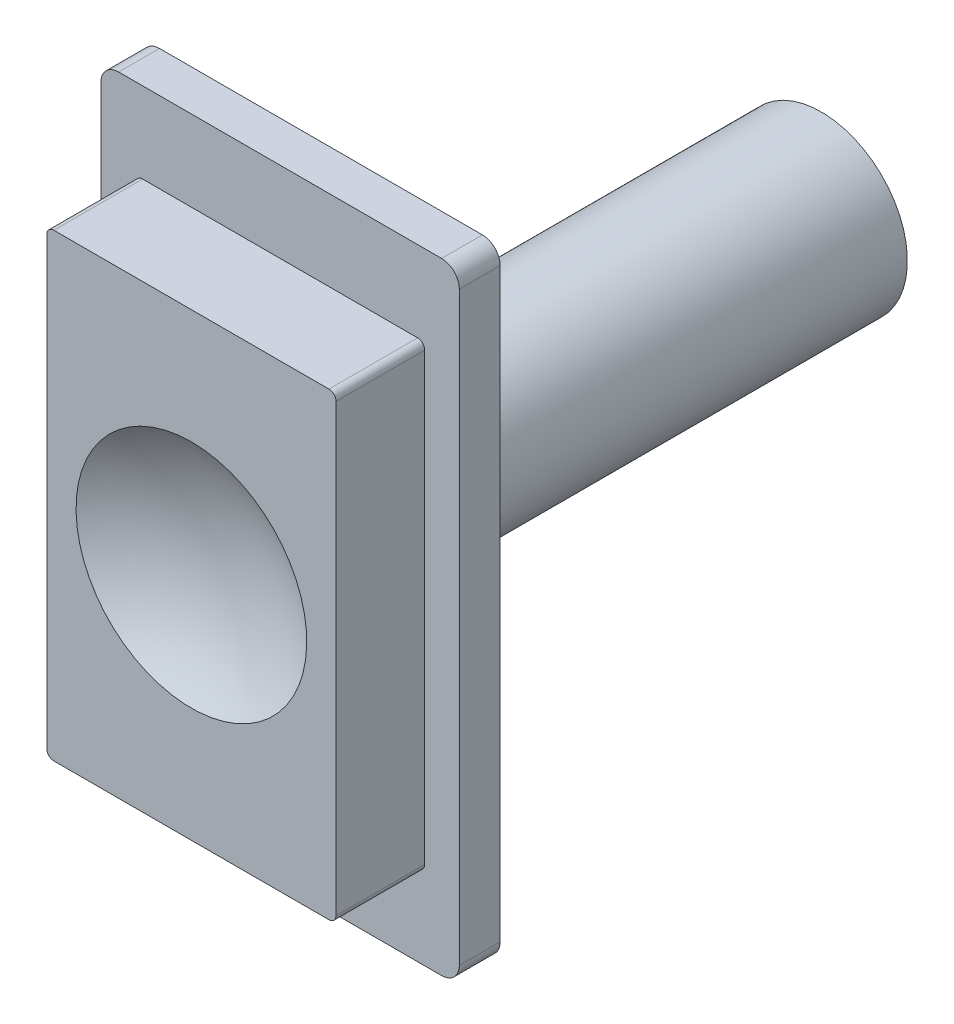
ISO-10303-21;
HEADER;
FILE_DESCRIPTION(('STEP AP214'),'2;1');
FILE_NAME('part.step','',(''),(''),'','','');
FILE_SCHEMA(('AUTOMOTIVE_DESIGN { 1 0 10303 214 1 1 1 1 }'));
ENDSEC;
DATA;
#1=APPLICATION_CONTEXT('core data for automotive mechanical design processes');
#2=APPLICATION_PROTOCOL_DEFINITION('international standard','automotive_design',2000,#1);
#3=PRODUCT_CONTEXT('',#1,'mechanical');
#4=PRODUCT('Part','Part','',(#3));
#5=PRODUCT_RELATED_PRODUCT_CATEGORY('part','',(#4));
#6=PRODUCT_DEFINITION_FORMATION('','',#4);
#7=PRODUCT_DEFINITION_CONTEXT('part definition',#1,'design');
#8=PRODUCT_DEFINITION('design','',#6,#7);
#9=PRODUCT_DEFINITION_SHAPE('','',#8);
#10=(LENGTH_UNIT() NAMED_UNIT(*) SI_UNIT(.MILLI.,.METRE.));
#11=(NAMED_UNIT(*) PLANE_ANGLE_UNIT() SI_UNIT($,.RADIAN.));
#12=(NAMED_UNIT(*) SI_UNIT($,.STERADIAN.) SOLID_ANGLE_UNIT());
#13=UNCERTAINTY_MEASURE_WITH_UNIT(LENGTH_MEASURE(1.E-05),#10,'distance_accuracy_value','');
#14=(GEOMETRIC_REPRESENTATION_CONTEXT(3) GLOBAL_UNCERTAINTY_ASSIGNED_CONTEXT((#13)) GLOBAL_UNIT_ASSIGNED_CONTEXT((#10,
#11,#12)) REPRESENTATION_CONTEXT('',''));
#15=CARTESIAN_POINT('',(0.,0.,0.));
#16=DIRECTION('',(0.,0.,1.));
#17=DIRECTION('',(1.,0.,0.));
#18=AXIS2_PLACEMENT_3D('',#15,#16,#17);
#19=CARTESIAN_POINT('',(0.,0.,2.3));
#20=DIRECTION('',(0.,0.,-1.));
#21=DIRECTION('',(-1.,0.,0.));
#22=AXIS2_PLACEMENT_3D('',#19,#20,#21);
#23=PLANE('',#22);
#24=DIRECTION('',(0.,-1.,0.));
#25=VECTOR('',#24,1.);
#26=CARTESIAN_POINT('',(-10.1,-17.5,2.3));
#27=LINE('',#26,#25);
#28=CARTESIAN_POINT('',(-10.1,16.5,2.3));
#29=VERTEX_POINT('',#28);
#30=CARTESIAN_POINT('',(-10.1,-16.5,2.3));
#31=VERTEX_POINT('',#30);
#32=EDGE_CURVE('E307',#29,#31,#27,.T.);
#33=ORIENTED_EDGE('',*,*,#32,.T.);
#34=CARTESIAN_POINT('',(-9.1,-16.5,2.3));
#35=DIRECTION('',(0.,0.,-1.));
#36=DIRECTION('',(-1.,0.,0.));
#37=AXIS2_PLACEMENT_3D('',#34,#35,#36);
#38=CIRCLE('',#37,1.);
#39=CARTESIAN_POINT('',(-9.1,-17.5,2.3));
#40=VERTEX_POINT('',#39);
#41=EDGE_CURVE('E351',#31,#40,#38,.F.);
#42=ORIENTED_EDGE('',*,*,#41,.T.);
#43=DIRECTION('',(1.,0.,0.));
#44=VECTOR('',#43,1.);
#45=CARTESIAN_POINT('',(10.1,-17.5,2.3));
#46=LINE('',#45,#44);
#47=CARTESIAN_POINT('',(9.1,-17.5,2.3));
#48=VERTEX_POINT('',#47);
#49=EDGE_CURVE('E311',#40,#48,#46,.T.);
#50=ORIENTED_EDGE('',*,*,#49,.T.);
#51=CARTESIAN_POINT('',(9.1,-16.5,2.3));
#52=DIRECTION('',(0.,0.,-1.));
#53=DIRECTION('',(-1.,0.,0.));
#54=AXIS2_PLACEMENT_3D('',#51,#52,#53);
#55=CIRCLE('',#54,1.);
#56=CARTESIAN_POINT('',(10.1,-16.5,2.3));
#57=VERTEX_POINT('',#56);
#58=EDGE_CURVE('E345',#48,#57,#55,.F.);
#59=ORIENTED_EDGE('',*,*,#58,.T.);
#60=DIRECTION('',(0.,1.,0.));
#61=VECTOR('',#60,1.);
#62=CARTESIAN_POINT('',(10.1,-17.5,2.3));
#63=LINE('',#62,#61);
#64=CARTESIAN_POINT('',(10.1,16.5,2.3));
#65=VERTEX_POINT('',#64);
#66=EDGE_CURVE('E314',#57,#65,#63,.T.);
#67=ORIENTED_EDGE('',*,*,#66,.T.);
#68=CARTESIAN_POINT('',(9.1,16.5,2.3));
#69=DIRECTION('',(0.,0.,-1.));
#70=DIRECTION('',(-1.,0.,0.));
#71=AXIS2_PLACEMENT_3D('',#68,#69,#70);
#72=CIRCLE('',#71,1.);
#73=CARTESIAN_POINT('',(9.1,17.5,2.3));
#74=VERTEX_POINT('',#73);
#75=EDGE_CURVE('E347',#65,#74,#72,.F.);
#76=ORIENTED_EDGE('',*,*,#75,.T.);
#77=DIRECTION('',(-1.,0.,0.));
#78=VECTOR('',#77,1.);
#79=CARTESIAN_POINT('',(10.1,17.5,2.3));
#80=LINE('',#79,#78);
#81=CARTESIAN_POINT('',(-9.1,17.5,2.3));
#82=VERTEX_POINT('',#81);
#83=EDGE_CURVE('E304',#74,#82,#80,.T.);
#84=ORIENTED_EDGE('',*,*,#83,.T.);
#85=CARTESIAN_POINT('',(-9.1,16.5,2.3));
#86=DIRECTION('',(0.,0.,-1.));
#87=DIRECTION('',(-1.,0.,0.));
#88=AXIS2_PLACEMENT_3D('',#85,#86,#87);
#89=CIRCLE('',#88,1.);
#90=EDGE_CURVE('E349',#82,#29,#89,.F.);
#91=ORIENTED_EDGE('',*,*,#90,.T.);
#92=EDGE_LOOP('',(#33,#42,#50,#59,#67,#76,#84,#91));
#93=FACE_BOUND('',#92,.T.);
#94=DIRECTION('',(0.,1.,0.));
#95=VECTOR('',#94,1.);
#96=CARTESIAN_POINT('',(8.15,-12.95,2.3));
#97=LINE('',#96,#95);
#98=CARTESIAN_POINT('',(8.15,-12.55,2.3));
#99=VERTEX_POINT('',#98);
#100=CARTESIAN_POINT('',(8.15,12.55,2.3));
#101=VERTEX_POINT('',#100);
#102=EDGE_CURVE('E280',#99,#101,#97,.T.);
#103=ORIENTED_EDGE('',*,*,#102,.F.);
#104=CARTESIAN_POINT('',(7.75,-12.55,2.3));
#105=DIRECTION('',(0.,0.,-1.));
#106=DIRECTION('',(-1.,0.,0.));
#107=AXIS2_PLACEMENT_3D('',#104,#105,#106);
#108=CIRCLE('',#107,0.4);
#109=CARTESIAN_POINT('',(7.75,-12.95,2.3));
#110=VERTEX_POINT('',#109);
#111=EDGE_CURVE('E63',#99,#110,#108,.T.);
#112=ORIENTED_EDGE('',*,*,#111,.T.);
#113=DIRECTION('',(1.,0.,0.));
#114=VECTOR('',#113,1.);
#115=CARTESIAN_POINT('',(-8.15,-12.95,2.3));
#116=LINE('',#115,#114);
#117=CARTESIAN_POINT('',(-7.75,-12.95,2.3));
#118=VERTEX_POINT('',#117);
#119=EDGE_CURVE('E285',#118,#110,#116,.T.);
#120=ORIENTED_EDGE('',*,*,#119,.F.);
#121=CARTESIAN_POINT('',(-7.75,-12.55,2.3));
#122=DIRECTION('',(0.,0.,-1.));
#123=DIRECTION('',(-1.,0.,0.));
#124=AXIS2_PLACEMENT_3D('',#121,#122,#123);
#125=CIRCLE('',#124,0.4);
#126=CARTESIAN_POINT('',(-8.15,-12.55,2.3));
#127=VERTEX_POINT('',#126);
#128=EDGE_CURVE('E43',#118,#127,#125,.T.);
#129=ORIENTED_EDGE('',*,*,#128,.T.);
#130=DIRECTION('',(0.,-1.,0.));
#131=VECTOR('',#130,1.);
#132=CARTESIAN_POINT('',(-8.15,-12.95,2.3));
#133=LINE('',#132,#131);
#134=CARTESIAN_POINT('',(-8.15,12.55,2.3));
#135=VERTEX_POINT('',#134);
#136=EDGE_CURVE('E300',#135,#127,#133,.T.);
#137=ORIENTED_EDGE('',*,*,#136,.F.);
#138=CARTESIAN_POINT('',(-7.75,12.55,2.3));
#139=DIRECTION('',(0.,0.,-1.));
#140=DIRECTION('',(-1.,0.,0.));
#141=AXIS2_PLACEMENT_3D('',#138,#139,#140);
#142=CIRCLE('',#141,0.4);
#143=CARTESIAN_POINT('',(-7.75,12.95,2.3));
#144=VERTEX_POINT('',#143);
#145=EDGE_CURVE('E391',#135,#144,#142,.T.);
#146=ORIENTED_EDGE('',*,*,#145,.T.);
#147=DIRECTION('',(-1.,0.,0.));
#148=VECTOR('',#147,1.);
#149=CARTESIAN_POINT('',(-8.15,12.95,2.3));
#150=LINE('',#149,#148);
#151=CARTESIAN_POINT('',(7.75,12.95,2.3));
#152=VERTEX_POINT('',#151);
#153=EDGE_CURVE('E297',#152,#144,#150,.T.);
#154=ORIENTED_EDGE('',*,*,#153,.F.);
#155=CARTESIAN_POINT('',(7.75,12.55,2.3));
#156=DIRECTION('',(0.,0.,-1.));
#157=DIRECTION('',(-1.,0.,0.));
#158=AXIS2_PLACEMENT_3D('',#155,#156,#157);
#159=CIRCLE('',#158,0.4);
#160=EDGE_CURVE('E393',#152,#101,#159,.T.);
#161=ORIENTED_EDGE('',*,*,#160,.T.);
#162=EDGE_LOOP('',(#103,#112,#120,#129,#137,#146,#154,#161));
#163=FACE_BOUND('',#162,.T.);
#164=ADVANCED_FACE('F39',(#93,#163),#23,.F.);
#165=CARTESIAN_POINT('',(10.1,17.5,2.3));
#166=DIRECTION('',(0.,-1.,0.));
#167=DIRECTION('',(0.,0.,-1.));
#168=AXIS2_PLACEMENT_3D('',#165,#166,#167);
#169=PLANE('',#168);
#170=DIRECTION('',(-1.,0.,0.));
#171=VECTOR('',#170,1.);
#172=CARTESIAN_POINT('',(10.1,17.5,0.));
#173=LINE('',#172,#171);
#174=CARTESIAN_POINT('',(9.1,17.5,0.));
#175=VERTEX_POINT('',#174);
#176=CARTESIAN_POINT('',(-9.1,17.5,0.));
#177=VERTEX_POINT('',#176);
#178=EDGE_CURVE('E294',#175,#177,#173,.T.);
#179=ORIENTED_EDGE('',*,*,#178,.T.);
#180=DIRECTION('',(0.,0.,-1.));
#181=VECTOR('',#180,1.);
#182=CARTESIAN_POINT('',(-9.1,17.5,2.3));
#183=LINE('',#182,#181);
#184=EDGE_CURVE('E356',#177,#82,#183,.F.);
#185=ORIENTED_EDGE('',*,*,#184,.T.);
#186=ORIENTED_EDGE('',*,*,#83,.F.);
#187=DIRECTION('',(0.,0.,-1.));
#188=VECTOR('',#187,1.);
#189=CARTESIAN_POINT('',(9.1,17.5,2.3));
#190=LINE('',#189,#188);
#191=EDGE_CURVE('E353',#74,#175,#190,.T.);
#192=ORIENTED_EDGE('',*,*,#191,.T.);
#193=EDGE_LOOP('',(#179,#185,#186,#192));
#194=FACE_BOUND('',#193,.T.);
#195=ADVANCED_FACE('F442',(#194),#169,.F.);
#196=CARTESIAN_POINT('',(-10.1,-17.5,2.3));
#197=DIRECTION('',(1.,0.,0.));
#198=DIRECTION('',(0.,0.,-1.));
#199=AXIS2_PLACEMENT_3D('',#196,#197,#198);
#200=PLANE('',#199);
#201=DIRECTION('',(0.,-1.,0.));
#202=VECTOR('',#201,1.);
#203=CARTESIAN_POINT('',(-10.1,-17.5,0.));
#204=LINE('',#203,#202);
#205=CARTESIAN_POINT('',(-10.1,16.5,0.));
#206=VERTEX_POINT('',#205);
#207=CARTESIAN_POINT('',(-10.1,-16.5,0.));
#208=VERTEX_POINT('',#207);
#209=EDGE_CURVE('E320',#206,#208,#204,.T.);
#210=ORIENTED_EDGE('',*,*,#209,.T.);
#211=DIRECTION('',(0.,0.,-1.));
#212=VECTOR('',#211,1.);
#213=CARTESIAN_POINT('',(-10.1,-16.5,2.3));
#214=LINE('',#213,#212);
#215=EDGE_CURVE('E343',#208,#31,#214,.F.);
#216=ORIENTED_EDGE('',*,*,#215,.T.);
#217=ORIENTED_EDGE('',*,*,#32,.F.);
#218=DIRECTION('',(0.,0.,-1.));
#219=VECTOR('',#218,1.);
#220=CARTESIAN_POINT('',(-10.1,16.5,2.3));
#221=LINE('',#220,#219);
#222=EDGE_CURVE('E340',#29,#206,#221,.T.);
#223=ORIENTED_EDGE('',*,*,#222,.T.);
#224=EDGE_LOOP('',(#210,#216,#217,#223));
#225=FACE_BOUND('',#224,.T.);
#226=ADVANCED_FACE('F449',(#225),#200,.F.);
#227=CARTESIAN_POINT('',(10.1,-17.5,2.3));
#228=DIRECTION('',(0.,1.,0.));
#229=DIRECTION('',(0.,0.,1.));
#230=AXIS2_PLACEMENT_3D('',#227,#228,#229);
#231=PLANE('',#230);
#232=ORIENTED_EDGE('',*,*,#49,.F.);
#233=DIRECTION('',(0.,0.,-1.));
#234=VECTOR('',#233,1.);
#235=CARTESIAN_POINT('',(-9.1,-17.5,2.3));
#236=LINE('',#235,#234);
#237=CARTESIAN_POINT('',(-9.1,-17.5,0.));
#238=VERTEX_POINT('',#237);
#239=EDGE_CURVE('E329',#40,#238,#236,.T.);
#240=ORIENTED_EDGE('',*,*,#239,.T.);
#241=DIRECTION('',(1.,0.,0.));
#242=VECTOR('',#241,1.);
#243=CARTESIAN_POINT('',(10.1,-17.5,0.));
#244=LINE('',#243,#242);
#245=CARTESIAN_POINT('',(9.1,-17.5,0.));
#246=VERTEX_POINT('',#245);
#247=EDGE_CURVE('E323',#238,#246,#244,.T.);
#248=ORIENTED_EDGE('',*,*,#247,.T.);
#249=DIRECTION('',(0.,0.,-1.));
#250=VECTOR('',#249,1.);
#251=CARTESIAN_POINT('',(9.1,-17.5,2.3));
#252=LINE('',#251,#250);
#253=EDGE_CURVE('E317',#246,#48,#252,.F.);
#254=ORIENTED_EDGE('',*,*,#253,.T.);
#255=EDGE_LOOP('',(#232,#240,#248,#254));
#256=FACE_BOUND('',#255,.T.);
#257=ADVANCED_FACE('F462',(#256),#231,.F.);
#258=CARTESIAN_POINT('',(10.1,-17.5,2.3));
#259=DIRECTION('',(-1.,0.,0.));
#260=DIRECTION('',(0.,0.,1.));
#261=AXIS2_PLACEMENT_3D('',#258,#259,#260);
#262=PLANE('',#261);
#263=DIRECTION('',(0.,1.,0.));
#264=VECTOR('',#263,1.);
#265=CARTESIAN_POINT('',(10.1,-17.5,0.));
#266=LINE('',#265,#264);
#267=CARTESIAN_POINT('',(10.1,-16.5,0.));
#268=VERTEX_POINT('',#267);
#269=CARTESIAN_POINT('',(10.1,16.5,0.));
#270=VERTEX_POINT('',#269);
#271=EDGE_CURVE('E308',#268,#270,#266,.T.);
#272=ORIENTED_EDGE('',*,*,#271,.T.);
#273=DIRECTION('',(0.,0.,-1.));
#274=VECTOR('',#273,1.);
#275=CARTESIAN_POINT('',(10.1,16.5,2.3));
#276=LINE('',#275,#274);
#277=EDGE_CURVE('E361',#270,#65,#276,.F.);
#278=ORIENTED_EDGE('',*,*,#277,.T.);
#279=ORIENTED_EDGE('',*,*,#66,.F.);
#280=DIRECTION('',(0.,0.,-1.));
#281=VECTOR('',#280,1.);
#282=CARTESIAN_POINT('',(10.1,-16.5,2.3));
#283=LINE('',#282,#281);
#284=EDGE_CURVE('E358',#57,#268,#283,.T.);
#285=ORIENTED_EDGE('',*,*,#284,.T.);
#286=EDGE_LOOP('',(#272,#278,#279,#285));
#287=FACE_BOUND('',#286,.T.);
#288=ADVANCED_FACE('F458',(#287),#262,.F.);
#289=CARTESIAN_POINT('',(0.,0.,0.));
#290=DIRECTION('',(0.,0.,-1.));
#291=DIRECTION('',(-1.,0.,0.));
#292=AXIS2_PLACEMENT_3D('',#289,#290,#291);
#293=PLANE('',#292);
#294=CARTESIAN_POINT('',(0.,0.,0.));
#295=DIRECTION('',(0.,0.,-1.));
#296=DIRECTION('',(-1.,0.,0.));
#297=AXIS2_PLACEMENT_3D('',#294,#295,#296);
#298=CIRCLE('',#297,4.85);
#299=CARTESIAN_POINT('',(-4.85,0.,0.));
#300=VERTEX_POINT('',#299);
#301=EDGE_CURVE('E11',#300,#300,#298,.T.);
#302=ORIENTED_EDGE('',*,*,#301,.F.);
#303=EDGE_LOOP('',(#302));
#304=FACE_BOUND('',#303,.T.);
#305=ORIENTED_EDGE('',*,*,#247,.F.);
#306=CARTESIAN_POINT('',(-9.1,-16.5,0.));
#307=DIRECTION('',(0.,0.,-1.));
#308=DIRECTION('',(-1.,0.,0.));
#309=AXIS2_PLACEMENT_3D('',#306,#307,#308);
#310=CIRCLE('',#309,1.);
#311=EDGE_CURVE('E338',#238,#208,#310,.T.);
#312=ORIENTED_EDGE('',*,*,#311,.T.);
#313=ORIENTED_EDGE('',*,*,#209,.F.);
#314=CARTESIAN_POINT('',(-9.1,16.5,0.));
#315=DIRECTION('',(0.,0.,-1.));
#316=DIRECTION('',(-1.,0.,0.));
#317=AXIS2_PLACEMENT_3D('',#314,#315,#316);
#318=CIRCLE('',#317,1.);
#319=EDGE_CURVE('E336',#206,#177,#318,.T.);
#320=ORIENTED_EDGE('',*,*,#319,.T.);
#321=ORIENTED_EDGE('',*,*,#178,.F.);
#322=CARTESIAN_POINT('',(9.1,16.5,0.));
#323=DIRECTION('',(0.,0.,-1.));
#324=DIRECTION('',(-1.,0.,0.));
#325=AXIS2_PLACEMENT_3D('',#322,#323,#324);
#326=CIRCLE('',#325,1.);
#327=EDGE_CURVE('E334',#175,#270,#326,.T.);
#328=ORIENTED_EDGE('',*,*,#327,.T.);
#329=ORIENTED_EDGE('',*,*,#271,.F.);
#330=CARTESIAN_POINT('',(9.1,-16.5,0.));
#331=DIRECTION('',(0.,0.,-1.));
#332=DIRECTION('',(-1.,0.,0.));
#333=AXIS2_PLACEMENT_3D('',#330,#331,#332);
#334=CIRCLE('',#333,1.);
#335=EDGE_CURVE('E332',#268,#246,#334,.T.);
#336=ORIENTED_EDGE('',*,*,#335,.T.);
#337=EDGE_LOOP('',(#305,#312,#313,#320,#321,#328,#329,#336));
#338=FACE_BOUND('',#337,.T.);
#339=ADVANCED_FACE('F455',(#304,#338),#293,.T.);
#340=CARTESIAN_POINT('',(8.15,-12.95,7.3));
#341=DIRECTION('',(-1.,0.,0.));
#342=DIRECTION('',(0.,0.,1.));
#343=AXIS2_PLACEMENT_3D('',#340,#341,#342);
#344=PLANE('',#343);
#345=ORIENTED_EDGE('',*,*,#102,.T.);
#346=DIRECTION('',(0.,0.,-1.));
#347=VECTOR('',#346,1.);
#348=CARTESIAN_POINT('',(8.15,12.55,7.3));
#349=LINE('',#348,#347);
#350=CARTESIAN_POINT('',(8.15,12.55,7.3));
#351=VERTEX_POINT('',#350);
#352=EDGE_CURVE('E384',#101,#351,#349,.F.);
#353=ORIENTED_EDGE('',*,*,#352,.T.);
#354=DIRECTION('',(0.,1.,0.));
#355=VECTOR('',#354,1.);
#356=CARTESIAN_POINT('',(8.15,-12.95,7.3));
#357=LINE('',#356,#355);
#358=CARTESIAN_POINT('',(8.15,-12.55,7.3));
#359=VERTEX_POINT('',#358);
#360=EDGE_CURVE('E281',#359,#351,#357,.T.);
#361=ORIENTED_EDGE('',*,*,#360,.F.);
#362=DIRECTION('',(0.,0.,-1.));
#363=VECTOR('',#362,1.);
#364=CARTESIAN_POINT('',(8.15,-12.55,7.3));
#365=LINE('',#364,#363);
#366=EDGE_CURVE('E381',#359,#99,#365,.T.);
#367=ORIENTED_EDGE('',*,*,#366,.T.);
#368=EDGE_LOOP('',(#345,#353,#361,#367));
#369=FACE_BOUND('',#368,.T.);
#370=ADVANCED_FACE('F416',(#369),#344,.F.);
#371=CARTESIAN_POINT('',(-8.15,12.95,7.3));
#372=DIRECTION('',(0.,-1.,0.));
#373=DIRECTION('',(0.,0.,-1.));
#374=AXIS2_PLACEMENT_3D('',#371,#372,#373);
#375=PLANE('',#374);
#376=ORIENTED_EDGE('',*,*,#153,.T.);
#377=DIRECTION('',(0.,0.,-1.));
#378=VECTOR('',#377,1.);
#379=CARTESIAN_POINT('',(-7.75,12.95,7.3));
#380=LINE('',#379,#378);
#381=CARTESIAN_POINT('',(-7.75,12.95,7.3));
#382=VERTEX_POINT('',#381);
#383=EDGE_CURVE('E371',#144,#382,#380,.F.);
#384=ORIENTED_EDGE('',*,*,#383,.T.);
#385=DIRECTION('',(-1.,0.,0.));
#386=VECTOR('',#385,1.);
#387=CARTESIAN_POINT('',(-8.15,12.95,7.3));
#388=LINE('',#387,#386);
#389=CARTESIAN_POINT('',(7.75,12.95,7.3));
#390=VERTEX_POINT('',#389);
#391=EDGE_CURVE('E284',#390,#382,#388,.T.);
#392=ORIENTED_EDGE('',*,*,#391,.F.);
#393=DIRECTION('',(0.,0.,-1.));
#394=VECTOR('',#393,1.);
#395=CARTESIAN_POINT('',(7.75,12.95,7.3));
#396=LINE('',#395,#394);
#397=EDGE_CURVE('E368',#390,#152,#396,.T.);
#398=ORIENTED_EDGE('',*,*,#397,.T.);
#399=EDGE_LOOP('',(#376,#384,#392,#398));
#400=FACE_BOUND('',#399,.T.);
#401=ADVANCED_FACE('F424',(#400),#375,.F.);
#402=CARTESIAN_POINT('',(-8.15,-12.95,7.3));
#403=DIRECTION('',(1.,0.,0.));
#404=DIRECTION('',(0.,0.,-1.));
#405=AXIS2_PLACEMENT_3D('',#402,#403,#404);
#406=PLANE('',#405);
#407=DIRECTION('',(0.,-1.,0.));
#408=VECTOR('',#407,1.);
#409=CARTESIAN_POINT('',(-8.15,-12.95,7.3));
#410=LINE('',#409,#408);
#411=CARTESIAN_POINT('',(-8.15,12.55,7.3));
#412=VERTEX_POINT('',#411);
#413=CARTESIAN_POINT('',(-8.15,-12.55,7.3));
#414=VERTEX_POINT('',#413);
#415=EDGE_CURVE('E288',#412,#414,#410,.T.);
#416=ORIENTED_EDGE('',*,*,#415,.F.);
#417=DIRECTION('',(0.,0.,-1.));
#418=VECTOR('',#417,1.);
#419=CARTESIAN_POINT('',(-8.15,12.55,7.3));
#420=LINE('',#419,#418);
#421=EDGE_CURVE('E365',#412,#135,#420,.T.);
#422=ORIENTED_EDGE('',*,*,#421,.T.);
#423=ORIENTED_EDGE('',*,*,#136,.T.);
#424=DIRECTION('',(0.,0.,-1.));
#425=VECTOR('',#424,1.);
#426=CARTESIAN_POINT('',(-8.15,-12.55,7.3));
#427=LINE('',#426,#425);
#428=EDGE_CURVE('E363',#127,#414,#427,.F.);
#429=ORIENTED_EDGE('',*,*,#428,.T.);
#430=EDGE_LOOP('',(#416,#422,#423,#429));
#431=FACE_BOUND('',#430,.T.);
#432=ADVANCED_FACE('F400',(#431),#406,.F.);
#433=CARTESIAN_POINT('',(-8.15,-12.95,7.3));
#434=DIRECTION('',(0.,1.,0.));
#435=DIRECTION('',(0.,0.,1.));
#436=AXIS2_PLACEMENT_3D('',#433,#434,#435);
#437=PLANE('',#436);
#438=ORIENTED_EDGE('',*,*,#119,.T.);
#439=DIRECTION('',(0.,0.,-1.));
#440=VECTOR('',#439,1.);
#441=CARTESIAN_POINT('',(7.75,-12.95,7.3));
#442=LINE('',#441,#440);
#443=CARTESIAN_POINT('',(7.75,-12.95,7.3));
#444=VERTEX_POINT('',#443);
#445=EDGE_CURVE('E389',#110,#444,#442,.F.);
#446=ORIENTED_EDGE('',*,*,#445,.T.);
#447=DIRECTION('',(1.,0.,0.));
#448=VECTOR('',#447,1.);
#449=CARTESIAN_POINT('',(-8.15,-12.95,7.3));
#450=LINE('',#449,#448);
#451=CARTESIAN_POINT('',(-7.75,-12.95,7.3));
#452=VERTEX_POINT('',#451);
#453=EDGE_CURVE('E291',#452,#444,#450,.T.);
#454=ORIENTED_EDGE('',*,*,#453,.F.);
#455=DIRECTION('',(0.,0.,-1.));
#456=VECTOR('',#455,1.);
#457=CARTESIAN_POINT('',(-7.75,-12.95,7.3));
#458=LINE('',#457,#456);
#459=EDGE_CURVE('E386',#452,#118,#458,.T.);
#460=ORIENTED_EDGE('',*,*,#459,.T.);
#461=EDGE_LOOP('',(#438,#446,#454,#460));
#462=FACE_BOUND('',#461,.T.);
#463=ADVANCED_FACE('F408',(#462),#437,.F.);
#464=CARTESIAN_POINT('',(0.,0.,7.3));
#465=DIRECTION('',(0.,0.,-1.));
#466=DIRECTION('',(-1.,0.,0.));
#467=AXIS2_PLACEMENT_3D('',#464,#465,#466);
#468=PLANE('',#467);
#469=CARTESIAN_POINT('',(0.,0.,7.3));
#470=DIRECTION('',(0.,0.,-1.));
#471=DIRECTION('',(0.,1.,0.));
#472=AXIS2_PLACEMENT_3D('',#469,#470,#471);
#473=CIRCLE('',#472,6.5);
#474=CARTESIAN_POINT('',(0.,6.49999999999999,7.30000000000001));
#475=VERTEX_POINT('',#474);
#476=EDGE_CURVE('E276',#475,#475,#473,.T.);
#477=ORIENTED_EDGE('',*,*,#476,.T.);
#478=EDGE_LOOP('',(#477));
#479=FACE_BOUND('',#478,.T.);
#480=ORIENTED_EDGE('',*,*,#391,.T.);
#481=CARTESIAN_POINT('',(-7.75,12.55,7.3));
#482=DIRECTION('',(0.,0.,-1.));
#483=DIRECTION('',(-1.,0.,0.));
#484=AXIS2_PLACEMENT_3D('',#481,#482,#483);
#485=CIRCLE('',#484,0.4);
#486=EDGE_CURVE('E379',#382,#412,#485,.F.);
#487=ORIENTED_EDGE('',*,*,#486,.T.);
#488=ORIENTED_EDGE('',*,*,#415,.T.);
#489=CARTESIAN_POINT('',(-7.75,-12.55,7.3));
#490=DIRECTION('',(0.,0.,-1.));
#491=DIRECTION('',(-1.,0.,0.));
#492=AXIS2_PLACEMENT_3D('',#489,#490,#491);
#493=CIRCLE('',#492,0.4);
#494=EDGE_CURVE('E373',#414,#452,#493,.F.);
#495=ORIENTED_EDGE('',*,*,#494,.T.);
#496=ORIENTED_EDGE('',*,*,#453,.T.);
#497=CARTESIAN_POINT('',(7.75,-12.55,7.3));
#498=DIRECTION('',(0.,0.,-1.));
#499=DIRECTION('',(-1.,0.,0.));
#500=AXIS2_PLACEMENT_3D('',#497,#498,#499);
#501=CIRCLE('',#500,0.4);
#502=EDGE_CURVE('E375',#444,#359,#501,.F.);
#503=ORIENTED_EDGE('',*,*,#502,.T.);
#504=ORIENTED_EDGE('',*,*,#360,.T.);
#505=CARTESIAN_POINT('',(7.75,12.55,7.3));
#506=DIRECTION('',(0.,0.,-1.));
#507=DIRECTION('',(-1.,0.,0.));
#508=AXIS2_PLACEMENT_3D('',#505,#506,#507);
#509=CIRCLE('',#508,0.4);
#510=EDGE_CURVE('E377',#351,#390,#509,.F.);
#511=ORIENTED_EDGE('',*,*,#510,.T.);
#512=EDGE_LOOP('',(#480,#487,#488,#495,#496,#503,#504,#511));
#513=FACE_BOUND('',#512,.T.);
#514=ADVANCED_FACE('F405',(#479,#513),#468,.F.);
#515=CARTESIAN_POINT('',(0.,-0.0444530885769621,17.0069725378751));
#516=DIRECTION('',(-1.,0.,0.));
#517=DIRECTION('',(0.,1.,0.));
#518=AXIS2_PLACEMENT_3D('',#515,#516,#517);
#519=CIRCLE('',#518,11.7070569350134);
#520=TRIMMED_CURVE('',#519,(PARAMETER_VALUE(-1.56699919864851)),
(PARAMETER_VALUE(1.56699919864851)),.T.,.PARAMETER.);
#521=CARTESIAN_POINT('',(0.,0.,17.0069725378751));
#522=DIRECTION('',(0.,0.,-1.));
#523=AXIS1_PLACEMENT('',#521,#522);
#524=SURFACE_OF_REVOLUTION('',#520,#523);
#525=CARTESIAN_POINT('',(0.,0.,5.3));
#526=VERTEX_POINT('',#525);
#527=VERTEX_LOOP('',#526);
#528=FACE_BOUND('',#527,.T.);
#529=ORIENTED_EDGE('',*,*,#476,.F.);
#530=EDGE_LOOP('',(#529));
#531=FACE_BOUND('',#530,.T.);
#532=ADVANCED_FACE('F474',(#528,#531),#524,.F.);
#533=CARTESIAN_POINT('',(-9.1,-16.5,2.3));
#534=DIRECTION('',(0.,0.,-1.));
#535=DIRECTION('',(-1.,0.,0.));
#536=AXIS2_PLACEMENT_3D('',#533,#534,#535);
#537=CYLINDRICAL_SURFACE('',#536,1.);
#538=ORIENTED_EDGE('',*,*,#41,.F.);
#539=ORIENTED_EDGE('',*,*,#215,.F.);
#540=ORIENTED_EDGE('',*,*,#311,.F.);
#541=ORIENTED_EDGE('',*,*,#239,.F.);
#542=EDGE_LOOP('',(#538,#539,#540,#541));
#543=FACE_BOUND('',#542,.T.);
#544=ADVANCED_FACE('F470',(#543),#537,.T.);
#545=CARTESIAN_POINT('',(-9.1,16.5,2.3));
#546=DIRECTION('',(0.,0.,-1.));
#547=DIRECTION('',(-1.,0.,0.));
#548=AXIS2_PLACEMENT_3D('',#545,#546,#547);
#549=CYLINDRICAL_SURFACE('',#548,1.);
#550=ORIENTED_EDGE('',*,*,#90,.F.);
#551=ORIENTED_EDGE('',*,*,#184,.F.);
#552=ORIENTED_EDGE('',*,*,#319,.F.);
#553=ORIENTED_EDGE('',*,*,#222,.F.);
#554=EDGE_LOOP('',(#550,#551,#552,#553));
#555=FACE_BOUND('',#554,.T.);
#556=ADVANCED_FACE('F473',(#555),#549,.T.);
#557=CARTESIAN_POINT('',(9.1,16.5,2.3));
#558=DIRECTION('',(0.,0.,-1.));
#559=DIRECTION('',(-1.,0.,0.));
#560=AXIS2_PLACEMENT_3D('',#557,#558,#559);
#561=CYLINDRICAL_SURFACE('',#560,1.);
#562=ORIENTED_EDGE('',*,*,#75,.F.);
#563=ORIENTED_EDGE('',*,*,#277,.F.);
#564=ORIENTED_EDGE('',*,*,#327,.F.);
#565=ORIENTED_EDGE('',*,*,#191,.F.);
#566=EDGE_LOOP('',(#562,#563,#564,#565));
#567=FACE_BOUND('',#566,.T.);
#568=ADVANCED_FACE('F438',(#567),#561,.T.);
#569=CARTESIAN_POINT('',(9.1,-16.5,2.3));
#570=DIRECTION('',(0.,0.,-1.));
#571=DIRECTION('',(-1.,0.,0.));
#572=AXIS2_PLACEMENT_3D('',#569,#570,#571);
#573=CYLINDRICAL_SURFACE('',#572,1.);
#574=ORIENTED_EDGE('',*,*,#58,.F.);
#575=ORIENTED_EDGE('',*,*,#253,.F.);
#576=ORIENTED_EDGE('',*,*,#335,.F.);
#577=ORIENTED_EDGE('',*,*,#284,.F.);
#578=EDGE_LOOP('',(#574,#575,#576,#577));
#579=FACE_BOUND('',#578,.T.);
#580=ADVANCED_FACE('F430',(#579),#573,.T.);
#581=CARTESIAN_POINT('',(-7.75,12.55,7.3));
#582=DIRECTION('',(0.,0.,-1.));
#583=DIRECTION('',(-1.,0.,0.));
#584=AXIS2_PLACEMENT_3D('',#581,#582,#583);
#585=CYLINDRICAL_SURFACE('',#584,0.4);
#586=ORIENTED_EDGE('',*,*,#486,.F.);
#587=ORIENTED_EDGE('',*,*,#383,.F.);
#588=ORIENTED_EDGE('',*,*,#145,.F.);
#589=ORIENTED_EDGE('',*,*,#421,.F.);
#590=EDGE_LOOP('',(#586,#587,#588,#589));
#591=FACE_BOUND('',#590,.T.);
#592=ADVANCED_FACE('F428',(#591),#585,.T.);
#593=CARTESIAN_POINT('',(7.75,12.55,7.3));
#594=DIRECTION('',(0.,0.,-1.));
#595=DIRECTION('',(-1.,0.,0.));
#596=AXIS2_PLACEMENT_3D('',#593,#594,#595);
#597=CYLINDRICAL_SURFACE('',#596,0.4);
#598=ORIENTED_EDGE('',*,*,#510,.F.);
#599=ORIENTED_EDGE('',*,*,#352,.F.);
#600=ORIENTED_EDGE('',*,*,#160,.F.);
#601=ORIENTED_EDGE('',*,*,#397,.F.);
#602=EDGE_LOOP('',(#598,#599,#600,#601));
#603=FACE_BOUND('',#602,.T.);
#604=ADVANCED_FACE('F419',(#603),#597,.T.);
#605=CARTESIAN_POINT('',(7.75,-12.55,7.3));
#606=DIRECTION('',(0.,0.,-1.));
#607=DIRECTION('',(-1.,0.,0.));
#608=AXIS2_PLACEMENT_3D('',#605,#606,#607);
#609=CYLINDRICAL_SURFACE('',#608,0.4);
#610=ORIENTED_EDGE('',*,*,#502,.F.);
#611=ORIENTED_EDGE('',*,*,#445,.F.);
#612=ORIENTED_EDGE('',*,*,#111,.F.);
#613=ORIENTED_EDGE('',*,*,#366,.F.);
#614=EDGE_LOOP('',(#610,#611,#612,#613));
#615=FACE_BOUND('',#614,.T.);
#616=ADVANCED_FACE('F411',(#615),#609,.T.);
#617=CARTESIAN_POINT('',(-7.75,-12.55,7.3));
#618=DIRECTION('',(0.,0.,-1.));
#619=DIRECTION('',(-1.,0.,0.));
#620=AXIS2_PLACEMENT_3D('',#617,#618,#619);
#621=CYLINDRICAL_SURFACE('',#620,0.4);
#622=ORIENTED_EDGE('',*,*,#494,.F.);
#623=ORIENTED_EDGE('',*,*,#428,.F.);
#624=ORIENTED_EDGE('',*,*,#128,.F.);
#625=ORIENTED_EDGE('',*,*,#459,.F.);
#626=EDGE_LOOP('',(#622,#623,#624,#625));
#627=FACE_BOUND('',#626,.T.);
#628=ADVANCED_FACE('F41',(#627),#621,.T.);
#629=CARTESIAN_POINT('',(0.,0.,-28.2));
#630=DIRECTION('',(0.,0.,1.));
#631=DIRECTION('',(1.,0.,0.));
#632=AXIS2_PLACEMENT_3D('',#629,#630,#631);
#633=CYLINDRICAL_SURFACE('',#632,4.85);
#634=CARTESIAN_POINT('',(0.,0.,-28.2));
#635=DIRECTION('',(0.,0.,-1.));
#636=DIRECTION('',(-1.,0.,0.));
#637=AXIS2_PLACEMENT_3D('',#634,#635,#636);
#638=CIRCLE('',#637,4.85);
#639=CARTESIAN_POINT('',(-4.85,0.,-28.2));
#640=VERTEX_POINT('',#639);
#641=EDGE_CURVE('E263',#640,#640,#638,.T.);
#642=ORIENTED_EDGE('',*,*,#641,.F.);
#643=EDGE_LOOP('',(#642));
#644=FACE_BOUND('',#643,.T.);
#645=ORIENTED_EDGE('',*,*,#301,.T.);
#646=EDGE_LOOP('',(#645));
#647=FACE_BOUND('',#646,.T.);
#648=ADVANCED_FACE('F538',(#644,#647),#633,.T.);
#649=CARTESIAN_POINT('',(0.,0.,-28.2));
#650=DIRECTION('',(0.,0.,-1.));
#651=DIRECTION('',(-1.,0.,0.));
#652=AXIS2_PLACEMENT_3D('',#649,#650,#651);
#653=PLANE('',#652);
#654=CARTESIAN_POINT('',(0.,0.,-28.2));
#655=DIRECTION('',(0.,0.,-1.));
#656=DIRECTION('',(-1.,0.,0.));
#657=AXIS2_PLACEMENT_3D('',#654,#655,#656);
#658=CIRCLE('',#657,2.3);
#659=CARTESIAN_POINT('',(0.5,2.24499443206436,-28.2));
#660=VERTEX_POINT('',#659);
#661=CARTESIAN_POINT('',(0.5,-2.24499443206436,-28.2));
#662=VERTEX_POINT('',#661);
#663=EDGE_CURVE('E55',#660,#662,#658,.T.);
#664=ORIENTED_EDGE('',*,*,#663,.F.);
#665=DIRECTION('',(0.,1.,0.));
#666=VECTOR('',#665,1.);
#667=CARTESIAN_POINT('',(0.499999999999999,0.,-28.2));
#668=LINE('',#667,#666);
#669=CARTESIAN_POINT('',(0.5,3.15,-28.2));
#670=VERTEX_POINT('',#669);
#671=EDGE_CURVE('E225',#660,#670,#668,.T.);
#672=ORIENTED_EDGE('',*,*,#671,.T.);
#673=DIRECTION('',(1.,0.,0.));
#674=VECTOR('',#673,1.);
#675=CARTESIAN_POINT('',(0.,3.15,-28.2));
#676=LINE('',#675,#674);
#677=CARTESIAN_POINT('',(-0.5,3.15,-28.2));
#678=VERTEX_POINT('',#677);
#679=EDGE_CURVE('E229',#678,#670,#676,.T.);
#680=ORIENTED_EDGE('',*,*,#679,.F.);
#681=DIRECTION('',(0.,1.,0.));
#682=VECTOR('',#681,1.);
#683=CARTESIAN_POINT('',(-0.500000000000001,0.,-28.2));
#684=LINE('',#683,#682);
#685=CARTESIAN_POINT('',(-0.5,2.24499443206436,-28.2));
#686=VERTEX_POINT('',#685);
#687=EDGE_CURVE('E256',#686,#678,#684,.T.);
#688=ORIENTED_EDGE('',*,*,#687,.F.);
#689=CARTESIAN_POINT('',(-0.5,-2.24499443206436,-28.2));
#690=VERTEX_POINT('',#689);
#691=EDGE_CURVE('E248',#690,#686,#658,.T.);
#692=ORIENTED_EDGE('',*,*,#691,.F.);
#693=DIRECTION('',(0.,-1.,0.));
#694=VECTOR('',#693,1.);
#695=CARTESIAN_POINT('',(-0.5,0.,-28.2));
#696=LINE('',#695,#694);
#697=CARTESIAN_POINT('',(-0.5,-3.15,-28.2));
#698=VERTEX_POINT('',#697);
#699=EDGE_CURVE('E253',#690,#698,#696,.T.);
#700=ORIENTED_EDGE('',*,*,#699,.T.);
#701=DIRECTION('',(1.,0.,0.));
#702=VECTOR('',#701,1.);
#703=CARTESIAN_POINT('',(0.,-3.15,-28.2));
#704=LINE('',#703,#702);
#705=CARTESIAN_POINT('',(0.5,-3.15,-28.2));
#706=VERTEX_POINT('',#705);
#707=EDGE_CURVE('E250',#698,#706,#704,.T.);
#708=ORIENTED_EDGE('',*,*,#707,.T.);
#709=DIRECTION('',(0.,-1.,0.));
#710=VECTOR('',#709,1.);
#711=CARTESIAN_POINT('',(0.5,0.,-28.2));
#712=LINE('',#711,#710);
#713=EDGE_CURVE('E247',#662,#706,#712,.T.);
#714=ORIENTED_EDGE('',*,*,#713,.F.);
#715=EDGE_LOOP('',(#664,#672,#680,#688,#692,#700,#708,#714));
#716=FACE_BOUND('',#715,.T.);
#717=ORIENTED_EDGE('',*,*,#641,.T.);
#718=EDGE_LOOP('',(#717));
#719=FACE_BOUND('',#718,.T.);
#720=ADVANCED_FACE('F546',(#716,#719),#653,.T.);
#721=CARTESIAN_POINT('',(0.,0.,-12.2));
#722=DIRECTION('',(0.,0.,-1.));
#723=DIRECTION('',(-1.,0.,0.));
#724=AXIS2_PLACEMENT_3D('',#721,#722,#723);
#725=CYLINDRICAL_SURFACE('',#724,2.3);
#726=ORIENTED_EDGE('',*,*,#663,.T.);
#727=DIRECTION('',(0.,0.,-1.));
#728=VECTOR('',#727,1.);
#729=CARTESIAN_POINT('',(0.5,-2.24499443206436,-12.2));
#730=LINE('',#729,#728);
#731=CARTESIAN_POINT('',(0.5,-2.24499443206436,-12.2));
#732=VERTEX_POINT('',#731);
#733=EDGE_CURVE('E203',#732,#662,#730,.T.);
#734=ORIENTED_EDGE('',*,*,#733,.F.);
#735=CARTESIAN_POINT('',(0.,0.,-12.2));
#736=DIRECTION('',(0.,0.,-1.));
#737=DIRECTION('',(-1.,0.,0.));
#738=AXIS2_PLACEMENT_3D('',#735,#736,#737);
#739=CIRCLE('',#738,2.3);
#740=CARTESIAN_POINT('',(0.5,2.24499443206436,-12.2));
#741=VERTEX_POINT('',#740);
#742=EDGE_CURVE('E207',#741,#732,#739,.T.);
#743=ORIENTED_EDGE('',*,*,#742,.F.);
#744=DIRECTION('',(0.,0.,-1.));
#745=VECTOR('',#744,1.);
#746=CARTESIAN_POINT('',(0.5,2.24499443206436,-12.2));
#747=LINE('',#746,#745);
#748=EDGE_CURVE('E261',#741,#660,#747,.T.);
#749=ORIENTED_EDGE('',*,*,#748,.T.);
#750=EDGE_LOOP('',(#726,#734,#743,#749));
#751=FACE_BOUND('',#750,.T.);
#752=ADVANCED_FACE('F205',(#751),#725,.F.);
#753=CARTESIAN_POINT('',(0.499999999999999,0.,-12.2));
#754=DIRECTION('',(-1.,0.,0.));
#755=DIRECTION('',(0.,-1.,0.));
#756=AXIS2_PLACEMENT_3D('',#753,#754,#755);
#757=PLANE('',#756);
#758=ORIENTED_EDGE('',*,*,#671,.F.);
#759=ORIENTED_EDGE('',*,*,#748,.F.);
#760=DIRECTION('',(0.,1.,0.));
#761=VECTOR('',#760,1.);
#762=CARTESIAN_POINT('',(0.499999999999999,0.,-12.2));
#763=LINE('',#762,#761);
#764=CARTESIAN_POINT('',(0.5,3.15,-12.2));
#765=VERTEX_POINT('',#764);
#766=EDGE_CURVE('E212',#741,#765,#763,.T.);
#767=ORIENTED_EDGE('',*,*,#766,.T.);
#768=DIRECTION('',(0.,0.,-1.));
#769=VECTOR('',#768,1.);
#770=CARTESIAN_POINT('',(0.5,3.15,-12.2));
#771=LINE('',#770,#769);
#772=EDGE_CURVE('E264',#765,#670,#771,.T.);
#773=ORIENTED_EDGE('',*,*,#772,.T.);
#774=EDGE_LOOP('',(#758,#759,#767,#773));
#775=FACE_BOUND('',#774,.T.);
#776=ADVANCED_FACE('F565',(#775),#757,.T.);
#777=CARTESIAN_POINT('',(0.,3.15,-12.2));
#778=DIRECTION('',(0.,1.,0.));
#779=DIRECTION('',(0.,0.,1.));
#780=AXIS2_PLACEMENT_3D('',#777,#778,#779);
#781=PLANE('',#780);
#782=ORIENTED_EDGE('',*,*,#679,.T.);
#783=ORIENTED_EDGE('',*,*,#772,.F.);
#784=DIRECTION('',(1.,0.,0.));
#785=VECTOR('',#784,1.);
#786=CARTESIAN_POINT('',(0.,3.15,-12.2));
#787=LINE('',#786,#785);
#788=CARTESIAN_POINT('',(-0.5,3.15,-12.2));
#789=VERTEX_POINT('',#788);
#790=EDGE_CURVE('E237',#789,#765,#787,.T.);
#791=ORIENTED_EDGE('',*,*,#790,.F.);
#792=DIRECTION('',(0.,0.,-1.));
#793=VECTOR('',#792,1.);
#794=CARTESIAN_POINT('',(-0.5,3.15,-12.2));
#795=LINE('',#794,#793);
#796=EDGE_CURVE('E266',#789,#678,#795,.T.);
#797=ORIENTED_EDGE('',*,*,#796,.T.);
#798=EDGE_LOOP('',(#782,#783,#791,#797));
#799=FACE_BOUND('',#798,.T.);
#800=ADVANCED_FACE('F575',(#799),#781,.F.);
#801=CARTESIAN_POINT('',(-0.500000000000001,0.,-12.2));
#802=DIRECTION('',(-1.,0.,0.));
#803=DIRECTION('',(0.,-1.,0.));
#804=AXIS2_PLACEMENT_3D('',#801,#802,#803);
#805=PLANE('',#804);
#806=ORIENTED_EDGE('',*,*,#687,.T.);
#807=ORIENTED_EDGE('',*,*,#796,.F.);
#808=DIRECTION('',(0.,1.,0.));
#809=VECTOR('',#808,1.);
#810=CARTESIAN_POINT('',(-0.500000000000001,0.,-12.2));
#811=LINE('',#810,#809);
#812=CARTESIAN_POINT('',(-0.5,2.24499443206436,-12.2));
#813=VERTEX_POINT('',#812);
#814=EDGE_CURVE('E232',#813,#789,#811,.T.);
#815=ORIENTED_EDGE('',*,*,#814,.F.);
#816=DIRECTION('',(0.,0.,-1.));
#817=VECTOR('',#816,1.);
#818=CARTESIAN_POINT('',(-0.5,2.24499443206436,-12.2));
#819=LINE('',#818,#817);
#820=EDGE_CURVE('E268',#813,#686,#819,.T.);
#821=ORIENTED_EDGE('',*,*,#820,.T.);
#822=EDGE_LOOP('',(#806,#807,#815,#821));
#823=FACE_BOUND('',#822,.T.);
#824=ADVANCED_FACE('F585',(#823),#805,.F.);
#825=ORIENTED_EDGE('',*,*,#691,.T.);
#826=ORIENTED_EDGE('',*,*,#820,.F.);
#827=CARTESIAN_POINT('',(-0.5,-2.24499443206436,-12.2));
#828=VERTEX_POINT('',#827);
#829=EDGE_CURVE('E227',#828,#813,#739,.T.);
#830=ORIENTED_EDGE('',*,*,#829,.F.);
#831=DIRECTION('',(0.,0.,-1.));
#832=VECTOR('',#831,1.);
#833=CARTESIAN_POINT('',(-0.5,-2.24499443206436,-12.2));
#834=LINE('',#833,#832);
#835=EDGE_CURVE('E270',#828,#690,#834,.T.);
#836=ORIENTED_EDGE('',*,*,#835,.T.);
#837=EDGE_LOOP('',(#825,#826,#830,#836));
#838=FACE_BOUND('',#837,.T.);
#839=ADVANCED_FACE('F567',(#838),#725,.F.);
#840=CARTESIAN_POINT('',(-0.5,0.,-12.2));
#841=DIRECTION('',(1.,0.,0.));
#842=DIRECTION('',(0.,0.,-1.));
#843=AXIS2_PLACEMENT_3D('',#840,#841,#842);
#844=PLANE('',#843);
#845=ORIENTED_EDGE('',*,*,#699,.F.);
#846=ORIENTED_EDGE('',*,*,#835,.F.);
#847=DIRECTION('',(0.,-1.,0.));
#848=VECTOR('',#847,1.);
#849=CARTESIAN_POINT('',(-0.5,0.,-12.2));
#850=LINE('',#849,#848);
#851=CARTESIAN_POINT('',(-0.5,-3.15,-12.2));
#852=VERTEX_POINT('',#851);
#853=EDGE_CURVE('E233',#828,#852,#850,.T.);
#854=ORIENTED_EDGE('',*,*,#853,.T.);
#855=DIRECTION('',(0.,0.,-1.));
#856=VECTOR('',#855,1.);
#857=CARTESIAN_POINT('',(-0.5,-3.15,-12.2));
#858=LINE('',#857,#856);
#859=EDGE_CURVE('E272',#852,#698,#858,.T.);
#860=ORIENTED_EDGE('',*,*,#859,.T.);
#861=EDGE_LOOP('',(#845,#846,#854,#860));
#862=FACE_BOUND('',#861,.T.);
#863=ADVANCED_FACE('F604',(#862),#844,.T.);
#864=CARTESIAN_POINT('',(0.,-3.15,-12.2));
#865=DIRECTION('',(0.,1.,0.));
#866=DIRECTION('',(0.,0.,1.));
#867=AXIS2_PLACEMENT_3D('',#864,#865,#866);
#868=PLANE('',#867);
#869=ORIENTED_EDGE('',*,*,#707,.F.);
#870=ORIENTED_EDGE('',*,*,#859,.F.);
#871=DIRECTION('',(1.,0.,0.));
#872=VECTOR('',#871,1.);
#873=CARTESIAN_POINT('',(0.,-3.15,-12.2));
#874=LINE('',#873,#872);
#875=CARTESIAN_POINT('',(0.5,-3.15,-12.2));
#876=VERTEX_POINT('',#875);
#877=EDGE_CURVE('E220',#852,#876,#874,.T.);
#878=ORIENTED_EDGE('',*,*,#877,.T.);
#879=DIRECTION('',(0.,0.,-1.));
#880=VECTOR('',#879,1.);
#881=CARTESIAN_POINT('',(0.5,-3.15,-12.2));
#882=LINE('',#881,#880);
#883=EDGE_CURVE('E211',#876,#706,#882,.T.);
#884=ORIENTED_EDGE('',*,*,#883,.T.);
#885=EDGE_LOOP('',(#869,#870,#878,#884));
#886=FACE_BOUND('',#885,.T.);
#887=ADVANCED_FACE('F613',(#886),#868,.T.);
#888=CARTESIAN_POINT('',(0.5,0.,-12.2));
#889=DIRECTION('',(1.,0.,0.));
#890=DIRECTION('',(0.,0.,-1.));
#891=AXIS2_PLACEMENT_3D('',#888,#889,#890);
#892=PLANE('',#891);
#893=ORIENTED_EDGE('',*,*,#713,.T.);
#894=ORIENTED_EDGE('',*,*,#883,.F.);
#895=DIRECTION('',(0.,-1.,0.));
#896=VECTOR('',#895,1.);
#897=CARTESIAN_POINT('',(0.5,0.,-12.2));
#898=LINE('',#897,#896);
#899=EDGE_CURVE('E216',#732,#876,#898,.T.);
#900=ORIENTED_EDGE('',*,*,#899,.F.);
#901=ORIENTED_EDGE('',*,*,#733,.T.);
#902=EDGE_LOOP('',(#893,#894,#900,#901));
#903=FACE_BOUND('',#902,.T.);
#904=ADVANCED_FACE('F217',(#903),#892,.F.);
#905=CARTESIAN_POINT('',(0.,0.,-12.2));
#906=DIRECTION('',(0.,0.,-1.));
#907=DIRECTION('',(-1.,0.,0.));
#908=AXIS2_PLACEMENT_3D('',#905,#906,#907);
#909=PLANE('',#908);
#910=ORIENTED_EDGE('',*,*,#742,.T.);
#911=ORIENTED_EDGE('',*,*,#899,.T.);
#912=ORIENTED_EDGE('',*,*,#877,.F.);
#913=ORIENTED_EDGE('',*,*,#853,.F.);
#914=ORIENTED_EDGE('',*,*,#829,.T.);
#915=ORIENTED_EDGE('',*,*,#814,.T.);
#916=ORIENTED_EDGE('',*,*,#790,.T.);
#917=ORIENTED_EDGE('',*,*,#766,.F.);
#918=EDGE_LOOP('',(#910,#911,#912,#913,#914,#915,#916,#917));
#919=FACE_BOUND('',#918,.T.);
#920=ADVANCED_FACE('F223',(#919),#909,.T.);
#921=CLOSED_SHELL('',(#164,#195,#226,#257,#288,#339,#370,#401,#432,#463,#514,#532,#544,#556,
#568,#580,#592,#604,#616,#628,#648,#720,#752,#776,#800,#824,#839,#863,#887,#904,#920));
#922=MANIFOLD_SOLID_BREP('B2',#921);
#923=ADVANCED_BREP_SHAPE_REPRESENTATION('',(#18,#922),#14);
#924=SHAPE_DEFINITION_REPRESENTATION(#9,#923);
ENDSEC;
END-ISO-10303-21;
